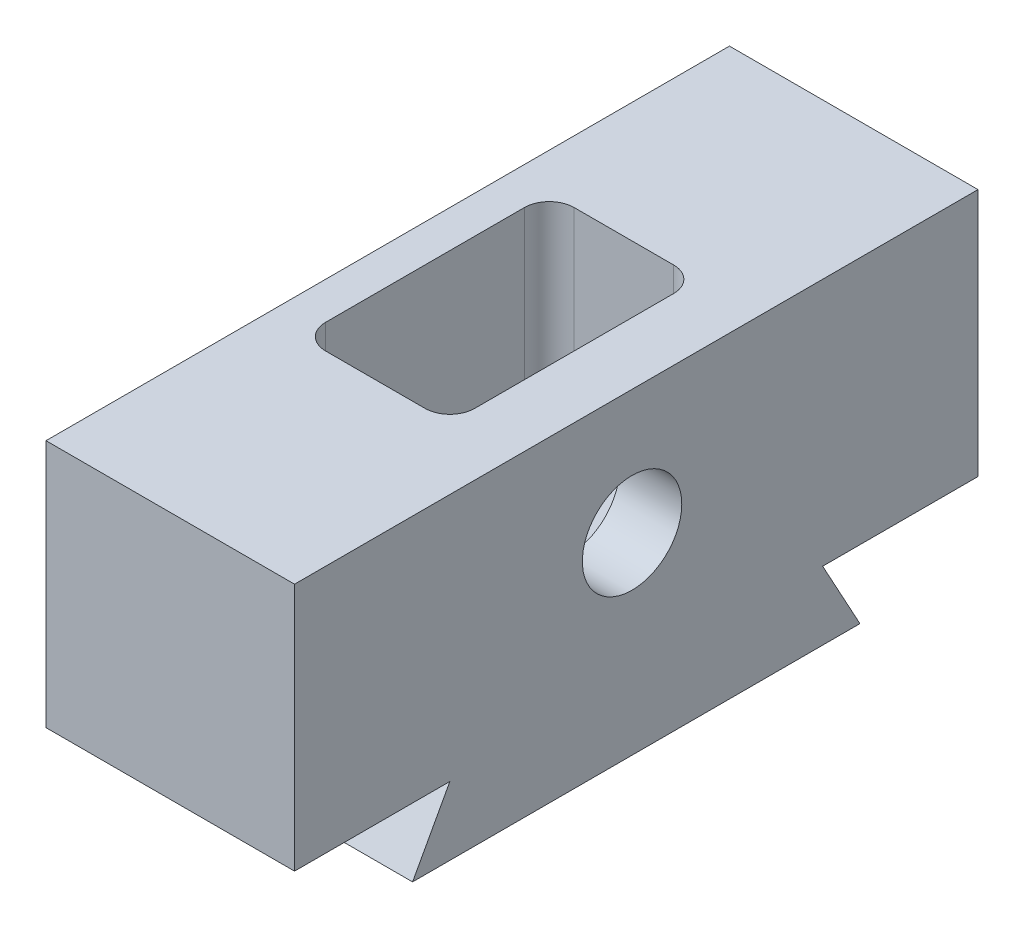
ISO-10303-21;
HEADER;
FILE_DESCRIPTION(('STEP AP214'),'2;1');
FILE_NAME('part.step','',(''),(''),'','','');
FILE_SCHEMA(('AUTOMOTIVE_DESIGN { 1 0 10303 214 1 1 1 1 }'));
ENDSEC;
DATA;
#1=APPLICATION_CONTEXT('core data for automotive mechanical design processes');
#2=APPLICATION_PROTOCOL_DEFINITION('international standard','automotive_design',2000,#1);
#3=PRODUCT_CONTEXT('',#1,'mechanical');
#4=PRODUCT('Part','Part','',(#3));
#5=PRODUCT_RELATED_PRODUCT_CATEGORY('part','',(#4));
#6=PRODUCT_DEFINITION_FORMATION('','',#4);
#7=PRODUCT_DEFINITION_CONTEXT('part definition',#1,'design');
#8=PRODUCT_DEFINITION('design','',#6,#7);
#9=PRODUCT_DEFINITION_SHAPE('','',#8);
#10=(LENGTH_UNIT() NAMED_UNIT(*) SI_UNIT(.MILLI.,.METRE.));
#11=(NAMED_UNIT(*) PLANE_ANGLE_UNIT() SI_UNIT($,.RADIAN.));
#12=(NAMED_UNIT(*) SI_UNIT($,.STERADIAN.) SOLID_ANGLE_UNIT());
#13=UNCERTAINTY_MEASURE_WITH_UNIT(LENGTH_MEASURE(1.E-05),#10,'distance_accuracy_value','');
#14=(GEOMETRIC_REPRESENTATION_CONTEXT(3) GLOBAL_UNCERTAINTY_ASSIGNED_CONTEXT((#13)) GLOBAL_UNIT_ASSIGNED_CONTEXT((#10,
#11,#12)) REPRESENTATION_CONTEXT('',''));
#15=CARTESIAN_POINT('',(0.,0.,0.));
#16=DIRECTION('',(0.,0.,1.));
#17=DIRECTION('',(1.,0.,0.));
#18=AXIS2_PLACEMENT_3D('',#15,#16,#17);
#19=CARTESIAN_POINT('',(10.,0.,0.));
#20=DIRECTION('',(0.,0.,1.));
#21=DIRECTION('',(0.,-1.,0.));
#22=AXIS2_PLACEMENT_3D('',#19,#20,#21);
#23=PLANE('',#22);
#24=DIRECTION('',(-1.,0.,0.));
#25=VECTOR('',#24,1.);
#26=CARTESIAN_POINT('',(10.,0.,0.));
#27=LINE('',#26,#25);
#28=CARTESIAN_POINT('',(10.,0.,0.));
#29=VERTEX_POINT('',#28);
#30=CARTESIAN_POINT('',(-10.,0.,0.));
#31=VERTEX_POINT('',#30);
#32=EDGE_CURVE('E12',#29,#31,#27,.T.);
#33=ORIENTED_EDGE('',*,*,#32,.F.);
#34=DIRECTION('',(0.,1.,0.));
#35=VECTOR('',#34,1.);
#36=CARTESIAN_POINT('',(10.,0.,0.));
#37=LINE('',#36,#35);
#38=CARTESIAN_POINT('',(10.,-20.,0.));
#39=VERTEX_POINT('',#38);
#40=EDGE_CURVE('E97',#39,#29,#37,.T.);
#41=ORIENTED_EDGE('',*,*,#40,.F.);
#42=DIRECTION('',(-1.,0.,0.));
#43=VECTOR('',#42,1.);
#44=CARTESIAN_POINT('',(10.,-20.,0.));
#45=LINE('',#44,#43);
#46=CARTESIAN_POINT('',(-10.,-20.,0.));
#47=VERTEX_POINT('',#46);
#48=EDGE_CURVE('E138',#39,#47,#45,.T.);
#49=ORIENTED_EDGE('',*,*,#48,.T.);
#50=DIRECTION('',(0.,1.,0.));
#51=VECTOR('',#50,1.);
#52=CARTESIAN_POINT('',(-10.,0.,0.));
#53=LINE('',#52,#51);
#54=EDGE_CURVE('E142',#47,#31,#53,.T.);
#55=ORIENTED_EDGE('',*,*,#54,.T.);
#56=EDGE_LOOP('',(#33,#41,#49,#55));
#57=FACE_BOUND('',#56,.T.);
#58=ADVANCED_FACE('F35',(#57),#23,.F.);
#59=CARTESIAN_POINT('',(10.,0.,0.));
#60=DIRECTION('',(0.,-1.,0.));
#61=DIRECTION('',(0.,0.,-1.));
#62=AXIS2_PLACEMENT_3D('',#59,#60,#61);
#63=PLANE('',#62);
#64=DIRECTION('',(1.,0.,0.));
#65=VECTOR('',#64,1.);
#66=CARTESIAN_POINT('',(3.,0.,37.5));
#67=LINE('',#66,#65);
#68=CARTESIAN_POINT('',(-5.,0.,37.5));
#69=VERTEX_POINT('',#68);
#70=CARTESIAN_POINT('',(3.,0.,37.5));
#71=VERTEX_POINT('',#70);
#72=EDGE_CURVE('E252',#69,#71,#67,.T.);
#73=ORIENTED_EDGE('',*,*,#72,.F.);
#74=CARTESIAN_POINT('',(-5.,0.,35.5));
#75=DIRECTION('',(0.,1.,0.));
#76=DIRECTION('',(0.,0.,-1.));
#77=AXIS2_PLACEMENT_3D('',#74,#75,#76);
#78=CIRCLE('',#77,2.);
#79=CARTESIAN_POINT('',(-7.,0.,35.5));
#80=VERTEX_POINT('',#79);
#81=EDGE_CURVE('E49',#80,#69,#78,.T.);
#82=ORIENTED_EDGE('',*,*,#81,.F.);
#83=DIRECTION('',(0.,0.,1.));
#84=VECTOR('',#83,1.);
#85=CARTESIAN_POINT('',(-7.,0.,19.5));
#86=LINE('',#85,#84);
#87=CARTESIAN_POINT('',(-7.,0.,19.5));
#88=VERTEX_POINT('',#87);
#89=EDGE_CURVE('E233',#88,#80,#86,.T.);
#90=ORIENTED_EDGE('',*,*,#89,.F.);
#91=CARTESIAN_POINT('',(-5.,0.,19.5));
#92=DIRECTION('',(0.,1.,0.));
#93=DIRECTION('',(0.,0.,1.));
#94=AXIS2_PLACEMENT_3D('',#91,#92,#93);
#95=CIRCLE('',#94,2.);
#96=CARTESIAN_POINT('',(-5.,0.,17.5));
#97=VERTEX_POINT('',#96);
#98=EDGE_CURVE('E237',#97,#88,#95,.T.);
#99=ORIENTED_EDGE('',*,*,#98,.F.);
#100=DIRECTION('',(-1.,0.,0.));
#101=VECTOR('',#100,1.);
#102=CARTESIAN_POINT('',(3.,0.,17.5));
#103=LINE('',#102,#101);
#104=CARTESIAN_POINT('',(3.,0.,17.5));
#105=VERTEX_POINT('',#104);
#106=EDGE_CURVE('E240',#105,#97,#103,.T.);
#107=ORIENTED_EDGE('',*,*,#106,.F.);
#108=CARTESIAN_POINT('',(3.,0.,19.5));
#109=DIRECTION('',(0.,1.,0.));
#110=DIRECTION('',(0.,0.,-1.));
#111=AXIS2_PLACEMENT_3D('',#108,#109,#110);
#112=CIRCLE('',#111,2.);
#113=CARTESIAN_POINT('',(5.,0.,19.5));
#114=VERTEX_POINT('',#113);
#115=EDGE_CURVE('E243',#114,#105,#112,.T.);
#116=ORIENTED_EDGE('',*,*,#115,.F.);
#117=DIRECTION('',(0.,0.,-1.));
#118=VECTOR('',#117,1.);
#119=CARTESIAN_POINT('',(5.,0.,19.5));
#120=LINE('',#119,#118);
#121=CARTESIAN_POINT('',(5.,0.,35.5));
#122=VERTEX_POINT('',#121);
#123=EDGE_CURVE('E246',#122,#114,#120,.T.);
#124=ORIENTED_EDGE('',*,*,#123,.F.);
#125=CARTESIAN_POINT('',(3.,0.,35.5));
#126=DIRECTION('',(0.,1.,0.));
#127=DIRECTION('',(0.,0.,-1.));
#128=AXIS2_PLACEMENT_3D('',#125,#126,#127);
#129=CIRCLE('',#128,2.);
#130=EDGE_CURVE('E249',#71,#122,#129,.T.);
#131=ORIENTED_EDGE('',*,*,#130,.F.);
#132=EDGE_LOOP('',(#73,#82,#90,#99,#107,#116,#124,#131));
#133=FACE_BOUND('',#132,.T.);
#134=DIRECTION('',(0.,0.,1.));
#135=VECTOR('',#134,1.);
#136=CARTESIAN_POINT('',(-10.,0.,0.));
#137=LINE('',#136,#135);
#138=CARTESIAN_POINT('',(-10.,0.,55.));
#139=VERTEX_POINT('',#138);
#140=EDGE_CURVE('E144',#31,#139,#137,.T.);
#141=ORIENTED_EDGE('',*,*,#140,.T.);
#142=DIRECTION('',(-1.,0.,0.));
#143=VECTOR('',#142,1.);
#144=CARTESIAN_POINT('',(10.,0.,55.));
#145=LINE('',#144,#143);
#146=CARTESIAN_POINT('',(10.,0.,55.));
#147=VERTEX_POINT('',#146);
#148=EDGE_CURVE('E42',#147,#139,#145,.T.);
#149=ORIENTED_EDGE('',*,*,#148,.F.);
#150=DIRECTION('',(0.,0.,1.));
#151=VECTOR('',#150,1.);
#152=CARTESIAN_POINT('',(10.,0.,0.));
#153=LINE('',#152,#151);
#154=EDGE_CURVE('E190',#29,#147,#153,.T.);
#155=ORIENTED_EDGE('',*,*,#154,.F.);
#156=ORIENTED_EDGE('',*,*,#32,.T.);
#157=EDGE_LOOP('',(#141,#149,#155,#156));
#158=FACE_BOUND('',#157,.T.);
#159=ADVANCED_FACE('F321',(#133,#158),#63,.F.);
#160=CARTESIAN_POINT('',(10.,0.,55.));
#161=DIRECTION('',(0.,0.,-1.));
#162=DIRECTION('',(-1.,0.,0.));
#163=AXIS2_PLACEMENT_3D('',#160,#161,#162);
#164=PLANE('',#163);
#165=DIRECTION('',(0.,-1.,0.));
#166=VECTOR('',#165,1.);
#167=CARTESIAN_POINT('',(-10.,0.,55.));
#168=LINE('',#167,#166);
#169=CARTESIAN_POINT('',(-10.,-20.,55.));
#170=VERTEX_POINT('',#169);
#171=EDGE_CURVE('E147',#139,#170,#168,.T.);
#172=ORIENTED_EDGE('',*,*,#171,.T.);
#173=DIRECTION('',(-1.,0.,0.));
#174=VECTOR('',#173,1.);
#175=CARTESIAN_POINT('',(10.,-20.,55.));
#176=LINE('',#175,#174);
#177=CARTESIAN_POINT('',(10.,-20.,55.));
#178=VERTEX_POINT('',#177);
#179=EDGE_CURVE('E163',#178,#170,#176,.T.);
#180=ORIENTED_EDGE('',*,*,#179,.F.);
#181=DIRECTION('',(0.,-1.,0.));
#182=VECTOR('',#181,1.);
#183=CARTESIAN_POINT('',(10.,0.,55.));
#184=LINE('',#183,#182);
#185=EDGE_CURVE('E172',#147,#178,#184,.T.);
#186=ORIENTED_EDGE('',*,*,#185,.F.);
#187=ORIENTED_EDGE('',*,*,#148,.T.);
#188=EDGE_LOOP('',(#172,#180,#186,#187));
#189=FACE_BOUND('',#188,.T.);
#190=ADVANCED_FACE('F170',(#189),#164,.F.);
#191=CARTESIAN_POINT('',(10.,-20.,55.));
#192=DIRECTION('',(0.,1.,0.));
#193=DIRECTION('',(0.,0.,1.));
#194=AXIS2_PLACEMENT_3D('',#191,#192,#193);
#195=PLANE('',#194);
#196=DIRECTION('',(0.,0.,-1.));
#197=VECTOR('',#196,1.);
#198=CARTESIAN_POINT('',(-10.,-20.,55.));
#199=LINE('',#198,#197);
#200=CARTESIAN_POINT('',(-10.,-20.,42.5));
#201=VERTEX_POINT('',#200);
#202=EDGE_CURVE('E149',#170,#201,#199,.T.);
#203=ORIENTED_EDGE('',*,*,#202,.T.);
#204=DIRECTION('',(-1.,0.,0.));
#205=VECTOR('',#204,1.);
#206=CARTESIAN_POINT('',(10.,-20.,42.5));
#207=LINE('',#206,#205);
#208=CARTESIAN_POINT('',(10.,-20.,42.5));
#209=VERTEX_POINT('',#208);
#210=EDGE_CURVE('E160',#209,#201,#207,.T.);
#211=ORIENTED_EDGE('',*,*,#210,.F.);
#212=DIRECTION('',(0.,0.,-1.));
#213=VECTOR('',#212,1.);
#214=CARTESIAN_POINT('',(10.,-20.,55.));
#215=LINE('',#214,#213);
#216=EDGE_CURVE('E186',#178,#209,#215,.T.);
#217=ORIENTED_EDGE('',*,*,#216,.F.);
#218=ORIENTED_EDGE('',*,*,#179,.T.);
#219=EDGE_LOOP('',(#203,#211,#217,#218));
#220=FACE_BOUND('',#219,.T.);
#221=ADVANCED_FACE('F182',(#220),#195,.F.);
#222=CARTESIAN_POINT('',(10.,-25.5,45.5));
#223=DIRECTION('',(0.,-0.478852130680574,-0.877895572914384));
#224=DIRECTION('',(0.,0.877895572914384,-0.478852130680574));
#225=AXIS2_PLACEMENT_3D('',#222,#223,#224);
#226=PLANE('',#225);
#227=DIRECTION('',(0.,-0.877895572914384,0.478852130680574));
#228=VECTOR('',#227,1.);
#229=CARTESIAN_POINT('',(-10.,-25.5,45.5));
#230=LINE('',#229,#228);
#231=CARTESIAN_POINT('',(-10.,-25.5,45.5));
#232=VERTEX_POINT('',#231);
#233=EDGE_CURVE('E151',#201,#232,#230,.T.);
#234=ORIENTED_EDGE('',*,*,#233,.T.);
#235=DIRECTION('',(-1.,0.,0.));
#236=VECTOR('',#235,1.);
#237=CARTESIAN_POINT('',(10.,-25.5,45.5));
#238=LINE('',#237,#236);
#239=CARTESIAN_POINT('',(10.,-25.5,45.5));
#240=VERTEX_POINT('',#239);
#241=EDGE_CURVE('E133',#240,#232,#238,.T.);
#242=ORIENTED_EDGE('',*,*,#241,.F.);
#243=DIRECTION('',(0.,-0.877895572914384,0.478852130680574));
#244=VECTOR('',#243,1.);
#245=CARTESIAN_POINT('',(10.,-25.5,45.5));
#246=LINE('',#245,#244);
#247=EDGE_CURVE('E121',#209,#240,#246,.T.);
#248=ORIENTED_EDGE('',*,*,#247,.F.);
#249=ORIENTED_EDGE('',*,*,#210,.T.);
#250=EDGE_LOOP('',(#234,#242,#248,#249));
#251=FACE_BOUND('',#250,.T.);
#252=ADVANCED_FACE('F185',(#251),#226,.F.);
#253=CARTESIAN_POINT('',(10.,-25.5,45.5));
#254=DIRECTION('',(0.,1.,0.));
#255=DIRECTION('',(0.,0.,1.));
#256=AXIS2_PLACEMENT_3D('',#253,#254,#255);
#257=PLANE('',#256);
#258=DIRECTION('',(0.,0.,-1.));
#259=VECTOR('',#258,1.);
#260=CARTESIAN_POINT('',(-10.,-25.5,45.5));
#261=LINE('',#260,#259);
#262=CARTESIAN_POINT('',(-10.,-25.5,9.5));
#263=VERTEX_POINT('',#262);
#264=EDGE_CURVE('E130',#232,#263,#261,.T.);
#265=ORIENTED_EDGE('',*,*,#264,.T.);
#266=DIRECTION('',(-1.,0.,0.));
#267=VECTOR('',#266,1.);
#268=CARTESIAN_POINT('',(10.,-25.5,9.5));
#269=LINE('',#268,#267);
#270=CARTESIAN_POINT('',(10.,-25.5,9.5));
#271=VERTEX_POINT('',#270);
#272=EDGE_CURVE('E127',#271,#263,#269,.T.);
#273=ORIENTED_EDGE('',*,*,#272,.F.);
#274=DIRECTION('',(0.,0.,-1.));
#275=VECTOR('',#274,1.);
#276=CARTESIAN_POINT('',(10.,-25.5,45.5));
#277=LINE('',#276,#275);
#278=EDGE_CURVE('E113',#240,#271,#277,.T.);
#279=ORIENTED_EDGE('',*,*,#278,.F.);
#280=ORIENTED_EDGE('',*,*,#241,.T.);
#281=EDGE_LOOP('',(#265,#273,#279,#280));
#282=FACE_BOUND('',#281,.T.);
#283=ADVANCED_FACE('F128',(#282),#257,.F.);
#284=CARTESIAN_POINT('',(10.,-25.5,9.5));
#285=DIRECTION('',(0.,-0.478852130680573,0.877895572914385));
#286=DIRECTION('',(0.,-0.877895572914385,-0.478852130680573));
#287=AXIS2_PLACEMENT_3D('',#284,#285,#286);
#288=PLANE('',#287);
#289=DIRECTION('',(0.,0.877895572914385,0.478852130680573));
#290=VECTOR('',#289,1.);
#291=CARTESIAN_POINT('',(-10.,-25.5,9.5));
#292=LINE('',#291,#290);
#293=CARTESIAN_POINT('',(-10.,-20.,12.5));
#294=VERTEX_POINT('',#293);
#295=EDGE_CURVE('E154',#263,#294,#292,.T.);
#296=ORIENTED_EDGE('',*,*,#295,.T.);
#297=DIRECTION('',(-1.,0.,0.));
#298=VECTOR('',#297,1.);
#299=CARTESIAN_POINT('',(10.,-20.,12.5));
#300=LINE('',#299,#298);
#301=CARTESIAN_POINT('',(10.,-20.,12.5));
#302=VERTEX_POINT('',#301);
#303=EDGE_CURVE('E134',#302,#294,#300,.T.);
#304=ORIENTED_EDGE('',*,*,#303,.F.);
#305=DIRECTION('',(0.,0.877895572914385,0.478852130680573));
#306=VECTOR('',#305,1.);
#307=CARTESIAN_POINT('',(10.,-25.5,9.5));
#308=LINE('',#307,#306);
#309=EDGE_CURVE('E118',#271,#302,#308,.T.);
#310=ORIENTED_EDGE('',*,*,#309,.F.);
#311=ORIENTED_EDGE('',*,*,#272,.T.);
#312=EDGE_LOOP('',(#296,#304,#310,#311));
#313=FACE_BOUND('',#312,.T.);
#314=ADVANCED_FACE('F136',(#313),#288,.F.);
#315=CARTESIAN_POINT('',(10.,-20.,12.5));
#316=DIRECTION('',(0.,1.,0.));
#317=DIRECTION('',(0.,0.,1.));
#318=AXIS2_PLACEMENT_3D('',#315,#316,#317);
#319=PLANE('',#318);
#320=DIRECTION('',(0.,0.,-1.));
#321=VECTOR('',#320,1.);
#322=CARTESIAN_POINT('',(-10.,-20.,12.5));
#323=LINE('',#322,#321);
#324=EDGE_CURVE('E91',#294,#47,#323,.T.);
#325=ORIENTED_EDGE('',*,*,#324,.T.);
#326=ORIENTED_EDGE('',*,*,#48,.F.);
#327=DIRECTION('',(0.,0.,-1.));
#328=VECTOR('',#327,1.);
#329=CARTESIAN_POINT('',(10.,-20.,12.5));
#330=LINE('',#329,#328);
#331=EDGE_CURVE('E58',#302,#39,#330,.T.);
#332=ORIENTED_EDGE('',*,*,#331,.F.);
#333=ORIENTED_EDGE('',*,*,#303,.T.);
#334=EDGE_LOOP('',(#325,#326,#332,#333));
#335=FACE_BOUND('',#334,.T.);
#336=ADVANCED_FACE('F363',(#335),#319,.F.);
#337=CARTESIAN_POINT('',(10.,0.,0.));
#338=DIRECTION('',(1.,0.,0.));
#339=DIRECTION('',(0.,0.,-1.));
#340=AXIS2_PLACEMENT_3D('',#337,#338,#339);
#341=PLANE('',#340);
#342=ORIENTED_EDGE('',*,*,#185,.T.);
#343=ORIENTED_EDGE('',*,*,#216,.T.);
#344=ORIENTED_EDGE('',*,*,#247,.T.);
#345=ORIENTED_EDGE('',*,*,#278,.T.);
#346=ORIENTED_EDGE('',*,*,#309,.T.);
#347=ORIENTED_EDGE('',*,*,#331,.T.);
#348=ORIENTED_EDGE('',*,*,#40,.T.);
#349=ORIENTED_EDGE('',*,*,#154,.T.);
#350=EDGE_LOOP('',(#342,#343,#344,#345,#346,#347,#348,#349));
#351=FACE_BOUND('',#350,.T.);
#352=CARTESIAN_POINT('',(10.,-10.,27.8388522117483));
#353=DIRECTION('',(1.,0.,0.));
#354=DIRECTION('',(0.,0.,-1.));
#355=AXIS2_PLACEMENT_3D('',#352,#353,#354);
#356=CIRCLE('',#355,4.);
#357=CARTESIAN_POINT('',(10.,-10.,23.8388522117483));
#358=VERTEX_POINT('',#357);
#359=EDGE_CURVE('E145',#358,#358,#356,.T.);
#360=ORIENTED_EDGE('',*,*,#359,.F.);
#361=EDGE_LOOP('',(#360));
#362=FACE_BOUND('',#361,.T.);
#363=ADVANCED_FACE('F115',(#351,#362),#341,.T.);
#364=CARTESIAN_POINT('',(-10.,0.,0.));
#365=DIRECTION('',(1.,0.,0.));
#366=DIRECTION('',(0.,0.,-1.));
#367=AXIS2_PLACEMENT_3D('',#364,#365,#366);
#368=PLANE('',#367);
#369=CARTESIAN_POINT('',(-10.,-9.,10.));
#370=DIRECTION('',(-1.,0.,0.));
#371=DIRECTION('',(0.,0.,1.));
#372=AXIS2_PLACEMENT_3D('',#369,#370,#371);
#373=CIRCLE('',#372,2.09999999999999);
#374=CARTESIAN_POINT('',(-10.,-9.,12.1));
#375=VERTEX_POINT('',#374);
#376=EDGE_CURVE('E204',#375,#375,#373,.T.);
#377=ORIENTED_EDGE('',*,*,#376,.F.);
#378=EDGE_LOOP('',(#377));
#379=FACE_BOUND('',#378,.T.);
#380=CARTESIAN_POINT('',(-10.,-9.,45.));
#381=DIRECTION('',(-1.,0.,0.));
#382=DIRECTION('',(0.,0.,1.));
#383=AXIS2_PLACEMENT_3D('',#380,#381,#382);
#384=CIRCLE('',#383,2.09999999999999);
#385=CARTESIAN_POINT('',(-10.,-9.,47.1));
#386=VERTEX_POINT('',#385);
#387=EDGE_CURVE('E198',#386,#386,#384,.T.);
#388=ORIENTED_EDGE('',*,*,#387,.F.);
#389=EDGE_LOOP('',(#388));
#390=FACE_BOUND('',#389,.T.);
#391=ORIENTED_EDGE('',*,*,#140,.F.);
#392=ORIENTED_EDGE('',*,*,#54,.F.);
#393=ORIENTED_EDGE('',*,*,#324,.F.);
#394=ORIENTED_EDGE('',*,*,#295,.F.);
#395=ORIENTED_EDGE('',*,*,#264,.F.);
#396=ORIENTED_EDGE('',*,*,#233,.F.);
#397=ORIENTED_EDGE('',*,*,#202,.F.);
#398=ORIENTED_EDGE('',*,*,#171,.F.);
#399=EDGE_LOOP('',(#391,#392,#393,#394,#395,#396,#397,#398));
#400=FACE_BOUND('',#399,.T.);
#401=ADVANCED_FACE('F177',(#379,#390,#400),#368,.F.);
#402=CARTESIAN_POINT('',(10.,-10.,27.8388522117483));
#403=DIRECTION('',(1.,0.,0.));
#404=DIRECTION('',(0.,0.,-1.));
#405=AXIS2_PLACEMENT_3D('',#402,#403,#404);
#406=CYLINDRICAL_SURFACE('',#405,4.);
#407=CARTESIAN_POINT('',(5.,-10.,27.8388522117483));
#408=DIRECTION('',(1.,0.,0.));
#409=DIRECTION('',(0.,0.,-1.));
#410=AXIS2_PLACEMENT_3D('',#407,#408,#409);
#411=CIRCLE('',#410,4.);
#412=CARTESIAN_POINT('',(5.,-10.,23.8388522117483));
#413=VERTEX_POINT('',#412);
#414=EDGE_CURVE('E207',#413,#413,#411,.F.);
#415=ORIENTED_EDGE('',*,*,#414,.T.);
#416=EDGE_LOOP('',(#415));
#417=FACE_BOUND('',#416,.T.);
#418=ORIENTED_EDGE('',*,*,#359,.T.);
#419=EDGE_LOOP('',(#418));
#420=FACE_BOUND('',#419,.T.);
#421=ADVANCED_FACE('F356',(#417,#420),#406,.F.);
#422=CARTESIAN_POINT('',(0.,-9.,45.));
#423=DIRECTION('',(-1.,0.,0.));
#424=DIRECTION('',(0.,0.,1.));
#425=AXIS2_PLACEMENT_3D('',#422,#423,#424);
#426=CONICAL_SURFACE('',#425,2.1,1.02974425867665);
#427=CARTESIAN_POINT('',(1.26180729995788,-9.00000000000001,45.));
#428=VERTEX_POINT('',#427);
#429=VERTEX_LOOP('',#428);
#430=FACE_BOUND('',#429,.T.);
#431=CARTESIAN_POINT('',(0.,-9.,45.));
#432=DIRECTION('',(-1.,0.,0.));
#433=DIRECTION('',(0.,0.,1.));
#434=AXIS2_PLACEMENT_3D('',#431,#432,#433);
#435=CIRCLE('',#434,2.1);
#436=CARTESIAN_POINT('',(0.,-9.,47.1));
#437=VERTEX_POINT('',#436);
#438=EDGE_CURVE('E195',#437,#437,#435,.T.);
#439=ORIENTED_EDGE('',*,*,#438,.T.);
#440=EDGE_LOOP('',(#439));
#441=FACE_BOUND('',#440,.T.);
#442=ADVANCED_FACE('F359',(#430,#441),#426,.F.);
#443=CARTESIAN_POINT('',(-10.,-9.,45.));
#444=DIRECTION('',(-1.,0.,0.));
#445=DIRECTION('',(0.,0.,1.));
#446=AXIS2_PLACEMENT_3D('',#443,#444,#445);
#447=CYLINDRICAL_SURFACE('',#446,2.09999999999999);
#448=ORIENTED_EDGE('',*,*,#438,.F.);
#449=EDGE_LOOP('',(#448));
#450=FACE_BOUND('',#449,.T.);
#451=ORIENTED_EDGE('',*,*,#387,.T.);
#452=EDGE_LOOP('',(#451));
#453=FACE_BOUND('',#452,.T.);
#454=ADVANCED_FACE('F415',(#450,#453),#447,.F.);
#455=CARTESIAN_POINT('',(0.,-9.,10.));
#456=DIRECTION('',(-1.,0.,0.));
#457=DIRECTION('',(0.,0.,1.));
#458=AXIS2_PLACEMENT_3D('',#455,#456,#457);
#459=CONICAL_SURFACE('',#458,2.1,1.02974425867665);
#460=CARTESIAN_POINT('',(1.26180729995788,-9.00000000000001,10.));
#461=VERTEX_POINT('',#460);
#462=VERTEX_LOOP('',#461);
#463=FACE_BOUND('',#462,.T.);
#464=CARTESIAN_POINT('',(0.,-9.,10.));
#465=DIRECTION('',(-1.,0.,0.));
#466=DIRECTION('',(0.,0.,1.));
#467=AXIS2_PLACEMENT_3D('',#464,#465,#466);
#468=CIRCLE('',#467,2.1);
#469=CARTESIAN_POINT('',(0.,-9.,12.1));
#470=VERTEX_POINT('',#469);
#471=EDGE_CURVE('E201',#470,#470,#468,.T.);
#472=ORIENTED_EDGE('',*,*,#471,.T.);
#473=EDGE_LOOP('',(#472));
#474=FACE_BOUND('',#473,.T.);
#475=ADVANCED_FACE('F425',(#463,#474),#459,.F.);
#476=CARTESIAN_POINT('',(-10.,-9.,10.));
#477=DIRECTION('',(-1.,0.,0.));
#478=DIRECTION('',(0.,0.,1.));
#479=AXIS2_PLACEMENT_3D('',#476,#477,#478);
#480=CYLINDRICAL_SURFACE('',#479,2.09999999999999);
#481=ORIENTED_EDGE('',*,*,#471,.F.);
#482=EDGE_LOOP('',(#481));
#483=FACE_BOUND('',#482,.T.);
#484=ORIENTED_EDGE('',*,*,#376,.T.);
#485=EDGE_LOOP('',(#484));
#486=FACE_BOUND('',#485,.T.);
#487=ADVANCED_FACE('F352',(#483,#486),#480,.F.);
#488=CARTESIAN_POINT('',(5.,-16.,19.5));
#489=DIRECTION('',(1.,0.,0.));
#490=DIRECTION('',(0.,0.,-1.));
#491=AXIS2_PLACEMENT_3D('',#488,#489,#490);
#492=PLANE('',#491);
#493=ORIENTED_EDGE('',*,*,#123,.T.);
#494=DIRECTION('',(0.,1.,0.));
#495=VECTOR('',#494,1.);
#496=CARTESIAN_POINT('',(5.,-16.,19.5));
#497=LINE('',#496,#495);
#498=CARTESIAN_POINT('',(5.,-16.,19.5));
#499=VERTEX_POINT('',#498);
#500=EDGE_CURVE('E220',#499,#114,#497,.T.);
#501=ORIENTED_EDGE('',*,*,#500,.F.);
#502=DIRECTION('',(0.,0.,-1.));
#503=VECTOR('',#502,1.);
#504=CARTESIAN_POINT('',(5.,-16.,19.5));
#505=LINE('',#504,#503);
#506=CARTESIAN_POINT('',(5.,-16.,35.5));
#507=VERTEX_POINT('',#506);
#508=EDGE_CURVE('E267',#507,#499,#505,.T.);
#509=ORIENTED_EDGE('',*,*,#508,.F.);
#510=DIRECTION('',(0.,1.,0.));
#511=VECTOR('',#510,1.);
#512=CARTESIAN_POINT('',(5.,-16.,35.5));
#513=LINE('',#512,#511);
#514=EDGE_CURVE('E217',#507,#122,#513,.T.);
#515=ORIENTED_EDGE('',*,*,#514,.T.);
#516=EDGE_LOOP('',(#493,#501,#509,#515));
#517=FACE_BOUND('',#516,.T.);
#518=ORIENTED_EDGE('',*,*,#414,.F.);
#519=EDGE_LOOP('',(#518));
#520=FACE_BOUND('',#519,.T.);
#521=ADVANCED_FACE('F349',(#517,#520),#492,.F.);
#522=CARTESIAN_POINT('',(-5.,-16.,35.5));
#523=DIRECTION('',(0.,1.,0.));
#524=DIRECTION('',(0.,0.,1.));
#525=AXIS2_PLACEMENT_3D('',#522,#523,#524);
#526=CYLINDRICAL_SURFACE('',#525,2.);
#527=ORIENTED_EDGE('',*,*,#81,.T.);
#528=DIRECTION('',(0.,1.,0.));
#529=VECTOR('',#528,1.);
#530=CARTESIAN_POINT('',(-5.,-16.,37.5));
#531=LINE('',#530,#529);
#532=CARTESIAN_POINT('',(-5.,-16.,37.5));
#533=VERTEX_POINT('',#532);
#534=EDGE_CURVE('E211',#533,#69,#531,.T.);
#535=ORIENTED_EDGE('',*,*,#534,.F.);
#536=CARTESIAN_POINT('',(-5.,-16.,35.5));
#537=DIRECTION('',(0.,1.,0.));
#538=DIRECTION('',(0.,0.,-1.));
#539=AXIS2_PLACEMENT_3D('',#536,#537,#538);
#540=CIRCLE('',#539,2.);
#541=CARTESIAN_POINT('',(-7.,-16.,35.5));
#542=VERTEX_POINT('',#541);
#543=EDGE_CURVE('E236',#542,#533,#540,.T.);
#544=ORIENTED_EDGE('',*,*,#543,.F.);
#545=DIRECTION('',(0.,1.,0.));
#546=VECTOR('',#545,1.);
#547=CARTESIAN_POINT('',(-7.,-16.,35.5));
#548=LINE('',#547,#546);
#549=EDGE_CURVE('E210',#542,#80,#548,.T.);
#550=ORIENTED_EDGE('',*,*,#549,.T.);
#551=EDGE_LOOP('',(#527,#535,#544,#550));
#552=FACE_BOUND('',#551,.T.);
#553=ADVANCED_FACE('F287',(#552),#526,.F.);
#554=CARTESIAN_POINT('',(-7.,-16.,19.5));
#555=DIRECTION('',(-1.,0.,0.));
#556=DIRECTION('',(0.,0.,1.));
#557=AXIS2_PLACEMENT_3D('',#554,#555,#556);
#558=PLANE('',#557);
#559=ORIENTED_EDGE('',*,*,#89,.T.);
#560=ORIENTED_EDGE('',*,*,#549,.F.);
#561=DIRECTION('',(0.,0.,1.));
#562=VECTOR('',#561,1.);
#563=CARTESIAN_POINT('',(-7.,-16.,19.5));
#564=LINE('',#563,#562);
#565=CARTESIAN_POINT('',(-7.,-16.,19.5));
#566=VERTEX_POINT('',#565);
#567=EDGE_CURVE('E214',#566,#542,#564,.T.);
#568=ORIENTED_EDGE('',*,*,#567,.F.);
#569=DIRECTION('',(0.,1.,0.));
#570=VECTOR('',#569,1.);
#571=CARTESIAN_POINT('',(-7.,-16.,19.5));
#572=LINE('',#571,#570);
#573=EDGE_CURVE('E229',#566,#88,#572,.T.);
#574=ORIENTED_EDGE('',*,*,#573,.T.);
#575=EDGE_LOOP('',(#559,#560,#568,#574));
#576=FACE_BOUND('',#575,.T.);
#577=ADVANCED_FACE('F311',(#576),#558,.F.);
#578=CARTESIAN_POINT('',(-5.,-16.,19.5));
#579=DIRECTION('',(0.,1.,0.));
#580=DIRECTION('',(0.,0.,1.));
#581=AXIS2_PLACEMENT_3D('',#578,#579,#580);
#582=CYLINDRICAL_SURFACE('',#581,2.);
#583=ORIENTED_EDGE('',*,*,#98,.T.);
#584=ORIENTED_EDGE('',*,*,#573,.F.);
#585=CARTESIAN_POINT('',(-5.,-16.,19.5));
#586=DIRECTION('',(0.,1.,0.));
#587=DIRECTION('',(0.,0.,1.));
#588=AXIS2_PLACEMENT_3D('',#585,#586,#587);
#589=CIRCLE('',#588,2.);
#590=CARTESIAN_POINT('',(-5.,-16.,17.5));
#591=VERTEX_POINT('',#590);
#592=EDGE_CURVE('E258',#591,#566,#589,.T.);
#593=ORIENTED_EDGE('',*,*,#592,.F.);
#594=DIRECTION('',(0.,1.,0.));
#595=VECTOR('',#594,1.);
#596=CARTESIAN_POINT('',(-5.,-16.,17.5));
#597=LINE('',#596,#595);
#598=EDGE_CURVE('E226',#591,#97,#597,.T.);
#599=ORIENTED_EDGE('',*,*,#598,.T.);
#600=EDGE_LOOP('',(#583,#584,#593,#599));
#601=FACE_BOUND('',#600,.T.);
#602=ADVANCED_FACE('F316',(#601),#582,.F.);
#603=CARTESIAN_POINT('',(3.,-16.,17.5));
#604=DIRECTION('',(0.,0.,-1.));
#605=DIRECTION('',(-1.,0.,0.));
#606=AXIS2_PLACEMENT_3D('',#603,#604,#605);
#607=PLANE('',#606);
#608=ORIENTED_EDGE('',*,*,#106,.T.);
#609=ORIENTED_EDGE('',*,*,#598,.F.);
#610=DIRECTION('',(-1.,0.,0.));
#611=VECTOR('',#610,1.);
#612=CARTESIAN_POINT('',(3.,-16.,17.5));
#613=LINE('',#612,#611);
#614=CARTESIAN_POINT('',(3.,-16.,17.5));
#615=VERTEX_POINT('',#614);
#616=EDGE_CURVE('E261',#615,#591,#613,.T.);
#617=ORIENTED_EDGE('',*,*,#616,.F.);
#618=DIRECTION('',(0.,1.,0.));
#619=VECTOR('',#618,1.);
#620=CARTESIAN_POINT('',(3.,-16.,17.5));
#621=LINE('',#620,#619);
#622=EDGE_CURVE('E223',#615,#105,#621,.T.);
#623=ORIENTED_EDGE('',*,*,#622,.T.);
#624=EDGE_LOOP('',(#608,#609,#617,#623));
#625=FACE_BOUND('',#624,.T.);
#626=ADVANCED_FACE('F343',(#625),#607,.F.);
#627=CARTESIAN_POINT('',(3.,-16.,19.5));
#628=DIRECTION('',(0.,1.,0.));
#629=DIRECTION('',(0.,0.,1.));
#630=AXIS2_PLACEMENT_3D('',#627,#628,#629);
#631=CYLINDRICAL_SURFACE('',#630,2.);
#632=ORIENTED_EDGE('',*,*,#115,.T.);
#633=ORIENTED_EDGE('',*,*,#622,.F.);
#634=CARTESIAN_POINT('',(3.,-16.,19.5));
#635=DIRECTION('',(0.,1.,0.));
#636=DIRECTION('',(0.,0.,-1.));
#637=AXIS2_PLACEMENT_3D('',#634,#635,#636);
#638=CIRCLE('',#637,2.);
#639=EDGE_CURVE('E264',#499,#615,#638,.T.);
#640=ORIENTED_EDGE('',*,*,#639,.F.);
#641=ORIENTED_EDGE('',*,*,#500,.T.);
#642=EDGE_LOOP('',(#632,#633,#640,#641));
#643=FACE_BOUND('',#642,.T.);
#644=ADVANCED_FACE('F346',(#643),#631,.F.);
#645=CARTESIAN_POINT('',(3.,-16.,35.5));
#646=DIRECTION('',(0.,1.,0.));
#647=DIRECTION('',(0.,0.,1.));
#648=AXIS2_PLACEMENT_3D('',#645,#646,#647);
#649=CYLINDRICAL_SURFACE('',#648,2.);
#650=ORIENTED_EDGE('',*,*,#130,.T.);
#651=ORIENTED_EDGE('',*,*,#514,.F.);
#652=CARTESIAN_POINT('',(3.,-16.,35.5));
#653=DIRECTION('',(0.,1.,0.));
#654=DIRECTION('',(0.,0.,-1.));
#655=AXIS2_PLACEMENT_3D('',#652,#653,#654);
#656=CIRCLE('',#655,2.);
#657=CARTESIAN_POINT('',(3.,-16.,37.5));
#658=VERTEX_POINT('',#657);
#659=EDGE_CURVE('E270',#658,#507,#656,.T.);
#660=ORIENTED_EDGE('',*,*,#659,.F.);
#661=DIRECTION('',(0.,1.,0.));
#662=VECTOR('',#661,1.);
#663=CARTESIAN_POINT('',(3.,-16.,37.5));
#664=LINE('',#663,#662);
#665=EDGE_CURVE('E213',#658,#71,#664,.T.);
#666=ORIENTED_EDGE('',*,*,#665,.T.);
#667=EDGE_LOOP('',(#650,#651,#660,#666));
#668=FACE_BOUND('',#667,.T.);
#669=ADVANCED_FACE('F332',(#668),#649,.F.);
#670=CARTESIAN_POINT('',(3.,-16.,37.5));
#671=DIRECTION('',(0.,0.,1.));
#672=DIRECTION('',(1.,0.,0.));
#673=AXIS2_PLACEMENT_3D('',#670,#671,#672);
#674=PLANE('',#673);
#675=ORIENTED_EDGE('',*,*,#72,.T.);
#676=ORIENTED_EDGE('',*,*,#665,.F.);
#677=DIRECTION('',(1.,0.,0.));
#678=VECTOR('',#677,1.);
#679=CARTESIAN_POINT('',(3.,-16.,37.5));
#680=LINE('',#679,#678);
#681=EDGE_CURVE('E273',#533,#658,#680,.T.);
#682=ORIENTED_EDGE('',*,*,#681,.F.);
#683=ORIENTED_EDGE('',*,*,#534,.T.);
#684=EDGE_LOOP('',(#675,#676,#682,#683));
#685=FACE_BOUND('',#684,.T.);
#686=ADVANCED_FACE('F326',(#685),#674,.F.);
#687=CARTESIAN_POINT('',(-5.,-16.,35.5));
#688=DIRECTION('',(0.,-1.,0.));
#689=DIRECTION('',(0.,0.,-1.));
#690=AXIS2_PLACEMENT_3D('',#687,#688,#689);
#691=PLANE('',#690);
#692=ORIENTED_EDGE('',*,*,#543,.T.);
#693=ORIENTED_EDGE('',*,*,#681,.T.);
#694=ORIENTED_EDGE('',*,*,#659,.T.);
#695=ORIENTED_EDGE('',*,*,#508,.T.);
#696=ORIENTED_EDGE('',*,*,#639,.T.);
#697=ORIENTED_EDGE('',*,*,#616,.T.);
#698=ORIENTED_EDGE('',*,*,#592,.T.);
#699=ORIENTED_EDGE('',*,*,#567,.T.);
#700=EDGE_LOOP('',(#692,#693,#694,#695,#696,#697,#698,#699));
#701=FACE_BOUND('',#700,.T.);
#702=ADVANCED_FACE('F280',(#701),#691,.F.);
#703=CLOSED_SHELL('',(#58,#159,#190,#221,#252,#283,#314,#336,#363,#401,#421,#442,#454,#475,#487,
#521,#553,#577,#602,#626,#644,#669,#686,#702));
#704=MANIFOLD_SOLID_BREP('B2',#703);
#705=ADVANCED_BREP_SHAPE_REPRESENTATION('',(#18,#704),#14);
#706=SHAPE_DEFINITION_REPRESENTATION(#9,#705);
ENDSEC;
END-ISO-10303-21;
